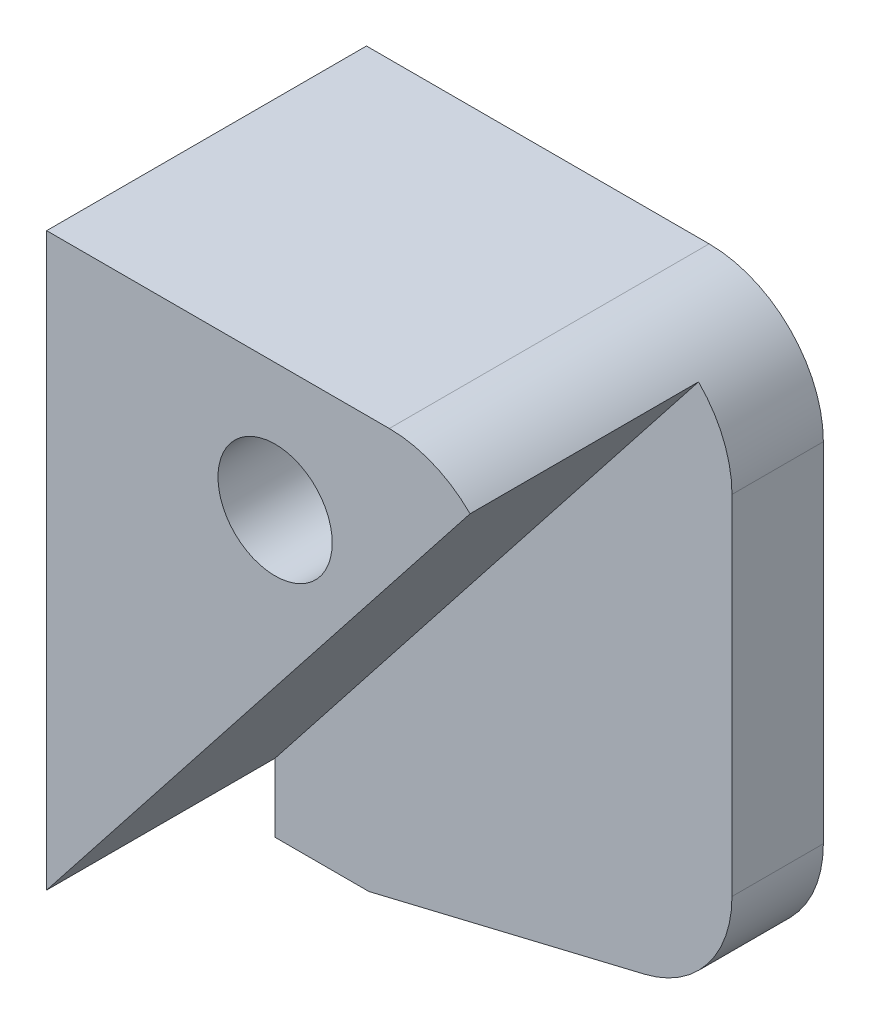
ISO-10303-21;
HEADER;
FILE_DESCRIPTION(('STEP AP214'),'2;1');
FILE_NAME('part.step','',(''),(''),'','','');
FILE_SCHEMA(('AUTOMOTIVE_DESIGN { 1 0 10303 214 1 1 1 1 }'));
ENDSEC;
DATA;
#1=APPLICATION_CONTEXT('core data for automotive mechanical design processes');
#2=APPLICATION_PROTOCOL_DEFINITION('international standard','automotive_design',2000,#1);
#3=PRODUCT_CONTEXT('',#1,'mechanical');
#4=PRODUCT('Part','Part','',(#3));
#5=PRODUCT_RELATED_PRODUCT_CATEGORY('part','',(#4));
#6=PRODUCT_DEFINITION_FORMATION('','',#4);
#7=PRODUCT_DEFINITION_CONTEXT('part definition',#1,'design');
#8=PRODUCT_DEFINITION('design','',#6,#7);
#9=PRODUCT_DEFINITION_SHAPE('','',#8);
#10=(LENGTH_UNIT() NAMED_UNIT(*) SI_UNIT(.MILLI.,.METRE.));
#11=(NAMED_UNIT(*) PLANE_ANGLE_UNIT() SI_UNIT($,.RADIAN.));
#12=(NAMED_UNIT(*) SI_UNIT($,.STERADIAN.) SOLID_ANGLE_UNIT());
#13=UNCERTAINTY_MEASURE_WITH_UNIT(LENGTH_MEASURE(1.E-05),#10,'distance_accuracy_value','');
#14=(GEOMETRIC_REPRESENTATION_CONTEXT(3) GLOBAL_UNCERTAINTY_ASSIGNED_CONTEXT((#13)) GLOBAL_UNIT_ASSIGNED_CONTEXT((#10,
#11,#12)) REPRESENTATION_CONTEXT('',''));
#15=CARTESIAN_POINT('',(0.,0.,0.));
#16=DIRECTION('',(0.,0.,1.));
#17=DIRECTION('',(1.,0.,0.));
#18=AXIS2_PLACEMENT_3D('',#15,#16,#17);
#19=CARTESIAN_POINT('',(0.,0.,4.));
#20=DIRECTION('',(0.,0.,1.));
#21=DIRECTION('',(1.,0.,0.));
#22=AXIS2_PLACEMENT_3D('',#19,#20,#21);
#23=PLANE('',#22);
#24=DIRECTION('',(0.,-1.,0.));
#25=VECTOR('',#24,1.);
#26=CARTESIAN_POINT('',(4.,0.,4.));
#27=LINE('',#26,#25);
#28=CARTESIAN_POINT('',(4.,15.,4.));
#29=VERTEX_POINT('',#28);
#30=CARTESIAN_POINT('',(4.,0.,4.));
#31=VERTEX_POINT('',#30);
#32=EDGE_CURVE('E11',#29,#31,#27,.T.);
#33=ORIENTED_EDGE('',*,*,#32,.F.);
#34=DIRECTION('',(1.,0.,0.));
#35=VECTOR('',#34,1.);
#36=CARTESIAN_POINT('',(0.,15.,4.));
#37=LINE('',#36,#35);
#38=CARTESIAN_POINT('',(0.,15.,4.));
#39=VERTEX_POINT('',#38);
#40=EDGE_CURVE('E190',#39,#29,#37,.T.);
#41=ORIENTED_EDGE('',*,*,#40,.F.);
#42=DIRECTION('',(0.,1.,0.));
#43=VECTOR('',#42,1.);
#44=CARTESIAN_POINT('',(0.,0.,4.));
#45=LINE('',#44,#43);
#46=CARTESIAN_POINT('',(0.,0.,4.));
#47=VERTEX_POINT('',#46);
#48=EDGE_CURVE('E194',#47,#39,#45,.T.);
#49=ORIENTED_EDGE('',*,*,#48,.F.);
#50=DIRECTION('',(-1.,0.,0.));
#51=VECTOR('',#50,1.);
#52=CARTESIAN_POINT('',(0.,0.,4.));
#53=LINE('',#52,#51);
#54=EDGE_CURVE('E198',#31,#47,#53,.T.);
#55=ORIENTED_EDGE('',*,*,#54,.F.);
#56=EDGE_LOOP('',(#33,#41,#49,#55));
#57=FACE_BOUND('',#56,.T.);
#58=ADVANCED_FACE('F41',(#57),#23,.T.);
#59=CARTESIAN_POINT('',(0.,-6.,4.));
#60=DIRECTION('',(0.,-1.,0.));
#61=DIRECTION('',(1.,0.,0.));
#62=AXIS2_PLACEMENT_3D('',#59,#60,#61);
#63=PLANE('',#62);
#64=DIRECTION('',(-1.,0.,0.));
#65=VECTOR('',#64,1.);
#66=CARTESIAN_POINT('',(0.,-6.,0.));
#67=LINE('',#66,#65);
#68=CARTESIAN_POINT('',(8.11076380065098,-6.,0.));
#69=VERTEX_POINT('',#68);
#70=CARTESIAN_POINT('',(4.,-6.,0.));
#71=VERTEX_POINT('',#70);
#72=EDGE_CURVE('E173',#69,#71,#67,.T.);
#73=ORIENTED_EDGE('',*,*,#72,.F.);
#74=DIRECTION('',(0.,0.,-1.));
#75=VECTOR('',#74,1.);
#76=CARTESIAN_POINT('',(8.11076380065098,-6.,4.));
#77=LINE('',#76,#75);
#78=CARTESIAN_POINT('',(8.11076380065098,-6.,4.));
#79=VERTEX_POINT('',#78);
#80=EDGE_CURVE('E255',#79,#69,#77,.T.);
#81=ORIENTED_EDGE('',*,*,#80,.F.);
#82=DIRECTION('',(-1.,0.,0.));
#83=VECTOR('',#82,1.);
#84=CARTESIAN_POINT('',(0.,-6.,4.));
#85=LINE('',#84,#83);
#86=CARTESIAN_POINT('',(4.,-6.,4.));
#87=VERTEX_POINT('',#86);
#88=EDGE_CURVE('E178',#79,#87,#85,.T.);
#89=ORIENTED_EDGE('',*,*,#88,.T.);
#90=DIRECTION('',(0.,0.,-1.));
#91=VECTOR('',#90,1.);
#92=CARTESIAN_POINT('',(4.,-6.,4.));
#93=LINE('',#92,#91);
#94=EDGE_CURVE('E203',#87,#71,#93,.T.);
#95=ORIENTED_EDGE('',*,*,#94,.T.);
#96=EDGE_LOOP('',(#73,#81,#89,#95));
#97=FACE_BOUND('',#96,.T.);
#98=ADVANCED_FACE('F306',(#97),#63,.T.);
#99=CARTESIAN_POINT('',(1.80511260454205,-7.51468830086219,4.));
#100=DIRECTION('',(-0.233567159699266,0.972340671734973,0.));
#101=DIRECTION('',(-0.972340671734973,-0.233567159699266,0.));
#102=AXIS2_PLACEMENT_3D('',#99,#100,#101);
#103=PLANE('',#102);
#104=DIRECTION('',(0.972340671734973,0.233567159699266,0.));
#105=VECTOR('',#104,1.);
#106=CARTESIAN_POINT('',(1.80511260454205,-7.51468830086219,0.));
#107=LINE('',#106,#105);
#108=CARTESIAN_POINT('',(20.1678357984963,-3.10375576925998,0.));
#109=VERTEX_POINT('',#108);
#110=EDGE_CURVE('E208',#69,#109,#107,.T.);
#111=ORIENTED_EDGE('',*,*,#110,.T.);
#112=DIRECTION('',(0.,0.,-1.));
#113=VECTOR('',#112,1.);
#114=CARTESIAN_POINT('',(20.1678357984963,-3.10375576925998,4.));
#115=LINE('',#114,#113);
#116=CARTESIAN_POINT('',(20.1678357984963,-3.10375576925998,4.));
#117=VERTEX_POINT('',#116);
#118=EDGE_CURVE('E66',#109,#117,#115,.F.);
#119=ORIENTED_EDGE('',*,*,#118,.T.);
#120=DIRECTION('',(0.972340671734973,0.233567159699266,0.));
#121=VECTOR('',#120,1.);
#122=CARTESIAN_POINT('',(1.80511260454205,-7.51468830086219,4.));
#123=LINE('',#122,#121);
#124=EDGE_CURVE('E182',#79,#117,#123,.T.);
#125=ORIENTED_EDGE('',*,*,#124,.F.);
#126=ORIENTED_EDGE('',*,*,#80,.T.);
#127=EDGE_LOOP('',(#111,#119,#125,#126));
#128=FACE_BOUND('',#127,.T.);
#129=ADVANCED_FACE('F329',(#128),#103,.F.);
#130=CARTESIAN_POINT('',(24.,0.,4.));
#131=DIRECTION('',(1.,0.,0.));
#132=DIRECTION('',(0.,1.,0.));
#133=AXIS2_PLACEMENT_3D('',#130,#131,#132);
#134=PLANE('',#133);
#135=DIRECTION('',(0.,-1.,0.));
#136=VECTOR('',#135,1.);
#137=CARTESIAN_POINT('',(24.,0.,4.));
#138=LINE('',#137,#136);
#139=CARTESIAN_POINT('',(24.,17.,4.));
#140=VERTEX_POINT('',#139);
#141=CARTESIAN_POINT('',(24.,1.75794758941488,4.));
#142=VERTEX_POINT('',#141);
#143=EDGE_CURVE('E186',#140,#142,#138,.T.);
#144=ORIENTED_EDGE('',*,*,#143,.T.);
#145=DIRECTION('',(0.,0.,-1.));
#146=VECTOR('',#145,1.);
#147=CARTESIAN_POINT('',(24.,1.75794758941488,0.));
#148=LINE('',#147,#146);
#149=CARTESIAN_POINT('',(24.,1.75794758941488,0.));
#150=VERTEX_POINT('',#149);
#151=EDGE_CURVE('E261',#142,#150,#148,.T.);
#152=ORIENTED_EDGE('',*,*,#151,.T.);
#153=DIRECTION('',(0.,-1.,0.));
#154=VECTOR('',#153,1.);
#155=CARTESIAN_POINT('',(24.,0.,0.));
#156=LINE('',#155,#154);
#157=CARTESIAN_POINT('',(24.,17.,0.));
#158=VERTEX_POINT('',#157);
#159=EDGE_CURVE('E211',#158,#150,#156,.T.);
#160=ORIENTED_EDGE('',*,*,#159,.F.);
#161=DIRECTION('',(0.,0.,-1.));
#162=VECTOR('',#161,1.);
#163=CARTESIAN_POINT('',(24.,17.,4.));
#164=LINE('',#163,#162);
#165=EDGE_CURVE('E258',#158,#140,#164,.F.);
#166=ORIENTED_EDGE('',*,*,#165,.T.);
#167=EDGE_LOOP('',(#144,#152,#160,#166));
#168=FACE_BOUND('',#167,.T.);
#169=ADVANCED_FACE('F334',(#168),#134,.T.);
#170=CARTESIAN_POINT('',(0.,22.,4.));
#171=DIRECTION('',(0.,1.,0.));
#172=DIRECTION('',(-1.,0.,0.));
#173=AXIS2_PLACEMENT_3D('',#170,#171,#172);
#174=PLANE('',#173);
#175=DIRECTION('',(0.,0.,-1.));
#176=VECTOR('',#175,1.);
#177=CARTESIAN_POINT('',(4.,22.,4.));
#178=LINE('',#177,#176);
#179=CARTESIAN_POINT('',(4.,22.,14.));
#180=VERTEX_POINT('',#179);
#181=CARTESIAN_POINT('',(4.,22.,0.));
#182=VERTEX_POINT('',#181);
#183=EDGE_CURVE('E252',#180,#182,#178,.T.);
#184=ORIENTED_EDGE('',*,*,#183,.F.);
#185=DIRECTION('',(-1.,0.,0.));
#186=VECTOR('',#185,1.);
#187=CARTESIAN_POINT('',(0.,22.,14.));
#188=LINE('',#187,#186);
#189=CARTESIAN_POINT('',(19.,22.,14.));
#190=VERTEX_POINT('',#189);
#191=EDGE_CURVE('E159',#190,#180,#188,.T.);
#192=ORIENTED_EDGE('',*,*,#191,.F.);
#193=DIRECTION('',(0.,0.,-1.));
#194=VECTOR('',#193,1.);
#195=CARTESIAN_POINT('',(19.,22.,4.));
#196=LINE('',#195,#194);
#197=CARTESIAN_POINT('',(19.,22.,0.));
#198=VERTEX_POINT('',#197);
#199=EDGE_CURVE('E45',#190,#198,#196,.T.);
#200=ORIENTED_EDGE('',*,*,#199,.T.);
#201=DIRECTION('',(1.,0.,0.));
#202=VECTOR('',#201,1.);
#203=CARTESIAN_POINT('',(0.,22.,0.));
#204=LINE('',#203,#202);
#205=EDGE_CURVE('E215',#182,#198,#204,.T.);
#206=ORIENTED_EDGE('',*,*,#205,.F.);
#207=EDGE_LOOP('',(#184,#192,#200,#206));
#208=FACE_BOUND('',#207,.T.);
#209=ADVANCED_FACE('F283',(#208),#174,.T.);
#210=CARTESIAN_POINT('',(0.,15.,4.));
#211=DIRECTION('',(0.,1.,0.));
#212=DIRECTION('',(0.,0.,1.));
#213=AXIS2_PLACEMENT_3D('',#210,#211,#212);
#214=PLANE('',#213);
#215=DIRECTION('',(1.,0.,0.));
#216=VECTOR('',#215,1.);
#217=CARTESIAN_POINT('',(0.,15.,0.));
#218=LINE('',#217,#216);
#219=CARTESIAN_POINT('',(0.,15.,0.));
#220=VERTEX_POINT('',#219);
#221=CARTESIAN_POINT('',(4.,15.,0.));
#222=VERTEX_POINT('',#221);
#223=EDGE_CURVE('E223',#220,#222,#218,.T.);
#224=ORIENTED_EDGE('',*,*,#223,.F.);
#225=DIRECTION('',(0.,0.,-1.));
#226=VECTOR('',#225,1.);
#227=CARTESIAN_POINT('',(0.,15.,4.));
#228=LINE('',#227,#226);
#229=EDGE_CURVE('E246',#39,#220,#228,.T.);
#230=ORIENTED_EDGE('',*,*,#229,.F.);
#231=ORIENTED_EDGE('',*,*,#40,.T.);
#232=DIRECTION('',(0.,0.,-1.));
#233=VECTOR('',#232,1.);
#234=CARTESIAN_POINT('',(4.,15.,4.));
#235=LINE('',#234,#233);
#236=EDGE_CURVE('E249',#29,#222,#235,.T.);
#237=ORIENTED_EDGE('',*,*,#236,.T.);
#238=EDGE_LOOP('',(#224,#230,#231,#237));
#239=FACE_BOUND('',#238,.T.);
#240=ADVANCED_FACE('F293',(#239),#214,.T.);
#241=CARTESIAN_POINT('',(0.,0.,4.));
#242=DIRECTION('',(-1.,0.,0.));
#243=DIRECTION('',(0.,0.,1.));
#244=AXIS2_PLACEMENT_3D('',#241,#242,#243);
#245=PLANE('',#244);
#246=DIRECTION('',(0.,1.,0.));
#247=VECTOR('',#246,1.);
#248=CARTESIAN_POINT('',(0.,0.,0.));
#249=LINE('',#248,#247);
#250=CARTESIAN_POINT('',(0.,0.,0.));
#251=VERTEX_POINT('',#250);
#252=EDGE_CURVE('E227',#251,#220,#249,.T.);
#253=ORIENTED_EDGE('',*,*,#252,.F.);
#254=DIRECTION('',(0.,0.,-1.));
#255=VECTOR('',#254,1.);
#256=CARTESIAN_POINT('',(0.,0.,4.));
#257=LINE('',#256,#255);
#258=EDGE_CURVE('E243',#47,#251,#257,.T.);
#259=ORIENTED_EDGE('',*,*,#258,.F.);
#260=ORIENTED_EDGE('',*,*,#48,.T.);
#261=ORIENTED_EDGE('',*,*,#229,.T.);
#262=EDGE_LOOP('',(#253,#259,#260,#261));
#263=FACE_BOUND('',#262,.T.);
#264=ADVANCED_FACE('F299',(#263),#245,.T.);
#265=CARTESIAN_POINT('',(0.,0.,4.));
#266=DIRECTION('',(0.,-1.,0.));
#267=DIRECTION('',(1.,0.,0.));
#268=AXIS2_PLACEMENT_3D('',#265,#266,#267);
#269=PLANE('',#268);
#270=DIRECTION('',(-1.,0.,0.));
#271=VECTOR('',#270,1.);
#272=CARTESIAN_POINT('',(0.,0.,0.));
#273=LINE('',#272,#271);
#274=CARTESIAN_POINT('',(4.,0.,0.));
#275=VERTEX_POINT('',#274);
#276=EDGE_CURVE('E231',#275,#251,#273,.T.);
#277=ORIENTED_EDGE('',*,*,#276,.F.);
#278=DIRECTION('',(0.,0.,-1.));
#279=VECTOR('',#278,1.);
#280=CARTESIAN_POINT('',(4.,0.,4.));
#281=LINE('',#280,#279);
#282=EDGE_CURVE('E240',#31,#275,#281,.T.);
#283=ORIENTED_EDGE('',*,*,#282,.F.);
#284=ORIENTED_EDGE('',*,*,#54,.T.);
#285=ORIENTED_EDGE('',*,*,#258,.T.);
#286=EDGE_LOOP('',(#277,#283,#284,#285));
#287=FACE_BOUND('',#286,.T.);
#288=ADVANCED_FACE('F302',(#287),#269,.T.);
#289=CARTESIAN_POINT('',(14.,16.41,4.));
#290=DIRECTION('',(0.,0.,-1.));
#291=DIRECTION('',(-1.,0.,0.));
#292=AXIS2_PLACEMENT_3D('',#289,#290,#291);
#293=CYLINDRICAL_SURFACE('',#292,2.5);
#294=CARTESIAN_POINT('',(14.,16.41,0.));
#295=DIRECTION('',(0.,0.,1.));
#296=DIRECTION('',(1.,0.,0.));
#297=AXIS2_PLACEMENT_3D('',#294,#295,#296);
#298=CIRCLE('',#297,2.5);
#299=CARTESIAN_POINT('',(16.5,16.41,0.));
#300=VERTEX_POINT('',#299);
#301=EDGE_CURVE('E168',#300,#300,#298,.T.);
#302=ORIENTED_EDGE('',*,*,#301,.F.);
#303=EDGE_LOOP('',(#302));
#304=FACE_BOUND('',#303,.T.);
#305=CARTESIAN_POINT('',(14.,16.41,14.));
#306=DIRECTION('',(0.,0.,1.));
#307=DIRECTION('',(1.,0.,0.));
#308=AXIS2_PLACEMENT_3D('',#305,#306,#307);
#309=CIRCLE('',#308,2.5);
#310=CARTESIAN_POINT('',(16.5,16.41,14.));
#311=VERTEX_POINT('',#310);
#312=EDGE_CURVE('E162',#311,#311,#309,.F.);
#313=ORIENTED_EDGE('',*,*,#312,.F.);
#314=EDGE_LOOP('',(#313));
#315=FACE_BOUND('',#314,.T.);
#316=ADVANCED_FACE('F320',(#304,#315),#293,.F.);
#317=CARTESIAN_POINT('',(4.,0.,4.));
#318=DIRECTION('',(-1.,0.,0.));
#319=DIRECTION('',(0.,0.,1.));
#320=AXIS2_PLACEMENT_3D('',#317,#318,#319);
#321=PLANE('',#320);
#322=DIRECTION('',(0.,1.,0.));
#323=VECTOR('',#322,1.);
#324=CARTESIAN_POINT('',(4.,0.,0.));
#325=LINE('',#324,#323);
#326=EDGE_CURVE('E183',#71,#275,#325,.T.);
#327=ORIENTED_EDGE('',*,*,#326,.F.);
#328=ORIENTED_EDGE('',*,*,#94,.F.);
#329=DIRECTION('',(0.,1.,0.));
#330=VECTOR('',#329,1.);
#331=CARTESIAN_POINT('',(4.,0.,4.));
#332=LINE('',#331,#330);
#333=CARTESIAN_POINT('',(4.,-3.,4.));
#334=VERTEX_POINT('',#333);
#335=EDGE_CURVE('E166',#87,#334,#332,.T.);
#336=ORIENTED_EDGE('',*,*,#335,.T.);
#337=DIRECTION('',(0.,0.,-1.));
#338=VECTOR('',#337,1.);
#339=CARTESIAN_POINT('',(4.,-3.,14.));
#340=LINE('',#339,#338);
#341=CARTESIAN_POINT('',(4.,-3.,14.));
#342=VERTEX_POINT('',#341);
#343=EDGE_CURVE('E145',#342,#334,#340,.T.);
#344=ORIENTED_EDGE('',*,*,#343,.F.);
#345=DIRECTION('',(0.,-1.,0.));
#346=VECTOR('',#345,1.);
#347=CARTESIAN_POINT('',(4.,0.,14.));
#348=LINE('',#347,#346);
#349=EDGE_CURVE('E153',#180,#342,#348,.T.);
#350=ORIENTED_EDGE('',*,*,#349,.F.);
#351=ORIENTED_EDGE('',*,*,#183,.T.);
#352=DIRECTION('',(0.,1.,0.));
#353=VECTOR('',#352,1.);
#354=CARTESIAN_POINT('',(4.,0.,0.));
#355=LINE('',#354,#353);
#356=EDGE_CURVE('E219',#222,#182,#355,.T.);
#357=ORIENTED_EDGE('',*,*,#356,.F.);
#358=ORIENTED_EDGE('',*,*,#236,.F.);
#359=ORIENTED_EDGE('',*,*,#32,.T.);
#360=ORIENTED_EDGE('',*,*,#282,.T.);
#361=EDGE_LOOP('',(#327,#328,#336,#344,#350,#351,#357,#358,#359,#360));
#362=FACE_BOUND('',#361,.T.);
#363=ADVANCED_FACE('F165',(#362),#321,.T.);
#364=DIRECTION('',(0.618715400930229,0.785615206479448,0.));
#365=VECTOR('',#364,1.);
#366=CARTESIAN_POINT('',(3.92698169296844,-3.09271515186003,4.));
#367=LINE('',#366,#365);
#368=CARTESIAN_POINT('',(22.5355339059327,20.5355339059327,4.));
#369=VERTEX_POINT('',#368);
#370=EDGE_CURVE('E58',#334,#369,#367,.T.);
#371=ORIENTED_EDGE('',*,*,#370,.F.);
#372=ORIENTED_EDGE('',*,*,#335,.F.);
#373=ORIENTED_EDGE('',*,*,#88,.F.);
#374=ORIENTED_EDGE('',*,*,#124,.T.);
#375=CARTESIAN_POINT('',(19.,1.75794758941488,4.));
#376=DIRECTION('',(0.,0.,1.));
#377=DIRECTION('',(1.,0.,0.));
#378=AXIS2_PLACEMENT_3D('',#375,#376,#377);
#379=CIRCLE('',#378,5.);
#380=EDGE_CURVE('E275',#117,#142,#379,.T.);
#381=ORIENTED_EDGE('',*,*,#380,.T.);
#382=ORIENTED_EDGE('',*,*,#143,.F.);
#383=CARTESIAN_POINT('',(19.,17.,4.));
#384=DIRECTION('',(0.,0.,1.));
#385=DIRECTION('',(1.,0.,0.));
#386=AXIS2_PLACEMENT_3D('',#383,#384,#385);
#387=CIRCLE('',#386,5.);
#388=EDGE_CURVE('E273',#140,#369,#387,.T.);
#389=ORIENTED_EDGE('',*,*,#388,.T.);
#390=EDGE_LOOP('',(#371,#372,#373,#374,#381,#382,#389));
#391=FACE_BOUND('',#390,.T.);
#392=ADVANCED_FACE('F308',(#391),#23,.T.);
#393=CARTESIAN_POINT('',(0.,0.,0.));
#394=DIRECTION('',(0.,0.,1.));
#395=DIRECTION('',(1.,0.,0.));
#396=AXIS2_PLACEMENT_3D('',#393,#394,#395);
#397=PLANE('',#396);
#398=ORIENTED_EDGE('',*,*,#301,.T.);
#399=EDGE_LOOP('',(#398));
#400=FACE_BOUND('',#399,.T.);
#401=ORIENTED_EDGE('',*,*,#159,.T.);
#402=CARTESIAN_POINT('',(19.,1.75794758941488,0.));
#403=DIRECTION('',(0.,0.,1.));
#404=DIRECTION('',(1.,0.,0.));
#405=AXIS2_PLACEMENT_3D('',#402,#403,#404);
#406=CIRCLE('',#405,5.);
#407=EDGE_CURVE('E268',#150,#109,#406,.F.);
#408=ORIENTED_EDGE('',*,*,#407,.T.);
#409=ORIENTED_EDGE('',*,*,#110,.F.);
#410=ORIENTED_EDGE('',*,*,#72,.T.);
#411=ORIENTED_EDGE('',*,*,#326,.T.);
#412=ORIENTED_EDGE('',*,*,#276,.T.);
#413=ORIENTED_EDGE('',*,*,#252,.T.);
#414=ORIENTED_EDGE('',*,*,#223,.T.);
#415=ORIENTED_EDGE('',*,*,#356,.T.);
#416=ORIENTED_EDGE('',*,*,#205,.T.);
#417=CARTESIAN_POINT('',(19.,17.,0.));
#418=DIRECTION('',(0.,0.,1.));
#419=DIRECTION('',(1.,0.,0.));
#420=AXIS2_PLACEMENT_3D('',#417,#418,#419);
#421=CIRCLE('',#420,5.);
#422=EDGE_CURVE('E265',#198,#158,#421,.F.);
#423=ORIENTED_EDGE('',*,*,#422,.T.);
#424=EDGE_LOOP('',(#401,#408,#409,#410,#411,#412,#413,#414,#415,#416,#423));
#425=FACE_BOUND('',#424,.T.);
#426=ADVANCED_FACE('F286',(#400,#425),#397,.F.);
#427=CARTESIAN_POINT('',(19.,1.75794758941488,4.));
#428=DIRECTION('',(0.,0.,1.));
#429=DIRECTION('',(1.,0.,0.));
#430=AXIS2_PLACEMENT_3D('',#427,#428,#429);
#431=CYLINDRICAL_SURFACE('',#430,5.);
#432=ORIENTED_EDGE('',*,*,#380,.F.);
#433=ORIENTED_EDGE('',*,*,#118,.F.);
#434=ORIENTED_EDGE('',*,*,#407,.F.);
#435=ORIENTED_EDGE('',*,*,#151,.F.);
#436=EDGE_LOOP('',(#432,#433,#434,#435));
#437=FACE_BOUND('',#436,.T.);
#438=ADVANCED_FACE('F316',(#437),#431,.T.);
#439=CARTESIAN_POINT('',(19.,17.,4.));
#440=DIRECTION('',(0.,0.,-1.));
#441=DIRECTION('',(-1.,0.,0.));
#442=AXIS2_PLACEMENT_3D('',#439,#440,#441);
#443=CYLINDRICAL_SURFACE('',#442,5.);
#444=ORIENTED_EDGE('',*,*,#388,.F.);
#445=ORIENTED_EDGE('',*,*,#165,.F.);
#446=ORIENTED_EDGE('',*,*,#422,.F.);
#447=ORIENTED_EDGE('',*,*,#199,.F.);
#448=CARTESIAN_POINT('',(19.,17.,14.));
#449=DIRECTION('',(0.,0.,1.));
#450=DIRECTION('',(1.,0.,0.));
#451=AXIS2_PLACEMENT_3D('',#448,#449,#450);
#452=CIRCLE('',#451,5.);
#453=CARTESIAN_POINT('',(22.5355339059327,20.5355339059327,14.));
#454=VERTEX_POINT('',#453);
#455=EDGE_CURVE('E152',#454,#190,#452,.T.);
#456=ORIENTED_EDGE('',*,*,#455,.F.);
#457=DIRECTION('',(0.,0.,-1.));
#458=VECTOR('',#457,1.);
#459=CARTESIAN_POINT('',(22.5355339059327,20.5355339059327,14.));
#460=LINE('',#459,#458);
#461=EDGE_CURVE('E147',#454,#369,#460,.T.);
#462=ORIENTED_EDGE('',*,*,#461,.T.);
#463=EDGE_LOOP('',(#444,#445,#446,#447,#456,#462));
#464=FACE_BOUND('',#463,.T.);
#465=ADVANCED_FACE('F43',(#464),#443,.T.);
#466=CARTESIAN_POINT('',(3.92698169296844,-3.09271515186003,14.));
#467=DIRECTION('',(-0.785615206479448,0.618715400930229,0.));
#468=DIRECTION('',(-0.618715400930229,-0.785615206479448,0.));
#469=AXIS2_PLACEMENT_3D('',#466,#467,#468);
#470=PLANE('',#469);
#471=ORIENTED_EDGE('',*,*,#370,.T.);
#472=ORIENTED_EDGE('',*,*,#461,.F.);
#473=DIRECTION('',(0.618715400930229,0.785615206479448,0.));
#474=VECTOR('',#473,1.);
#475=CARTESIAN_POINT('',(3.92698169296844,-3.09271515186003,14.));
#476=LINE('',#475,#474);
#477=EDGE_CURVE('E141',#342,#454,#476,.T.);
#478=ORIENTED_EDGE('',*,*,#477,.F.);
#479=ORIENTED_EDGE('',*,*,#343,.T.);
#480=EDGE_LOOP('',(#471,#472,#478,#479));
#481=FACE_BOUND('',#480,.T.);
#482=ADVANCED_FACE('F143',(#481),#470,.F.);
#483=CARTESIAN_POINT('',(0.,0.,14.));
#484=DIRECTION('',(0.,0.,1.));
#485=DIRECTION('',(1.,0.,0.));
#486=AXIS2_PLACEMENT_3D('',#483,#484,#485);
#487=PLANE('',#486);
#488=ORIENTED_EDGE('',*,*,#312,.T.);
#489=EDGE_LOOP('',(#488));
#490=FACE_BOUND('',#489,.T.);
#491=ORIENTED_EDGE('',*,*,#349,.T.);
#492=ORIENTED_EDGE('',*,*,#477,.T.);
#493=ORIENTED_EDGE('',*,*,#455,.T.);
#494=ORIENTED_EDGE('',*,*,#191,.T.);
#495=EDGE_LOOP('',(#491,#492,#493,#494));
#496=FACE_BOUND('',#495,.T.);
#497=ADVANCED_FACE('F157',(#490,#496),#487,.T.);
#498=CLOSED_SHELL('',(#58,#98,#129,#169,#209,#240,#264,#288,#316,#363,#392,#426,#438,#465,#482,#497));
#499=MANIFOLD_SOLID_BREP('B2',#498);
#500=ADVANCED_BREP_SHAPE_REPRESENTATION('',(#18,#499),#14);
#501=SHAPE_DEFINITION_REPRESENTATION(#9,#500);
ENDSEC;
END-ISO-10303-21;
